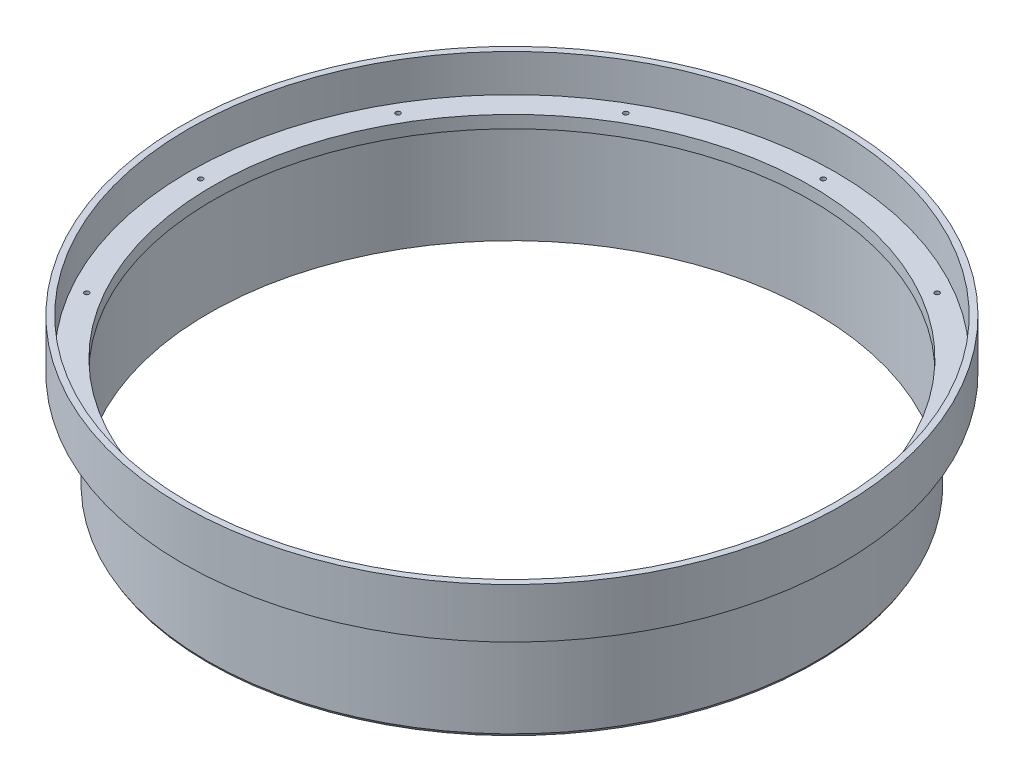
ISO-10303-21;
HEADER;
FILE_DESCRIPTION(('STEP AP214'),'2;1');
FILE_NAME('part.step','',(''),(''),'','','');
FILE_SCHEMA(('AUTOMOTIVE_DESIGN { 1 0 10303 214 1 1 1 1 }'));
ENDSEC;
DATA;
#1=APPLICATION_CONTEXT('core data for automotive mechanical design processes');
#2=APPLICATION_PROTOCOL_DEFINITION('international standard','automotive_design',2000,#1);
#3=PRODUCT_CONTEXT('',#1,'mechanical');
#4=PRODUCT('Part','Part','',(#3));
#5=PRODUCT_RELATED_PRODUCT_CATEGORY('part','',(#4));
#6=PRODUCT_DEFINITION_FORMATION('','',#4);
#7=PRODUCT_DEFINITION_CONTEXT('part definition',#1,'design');
#8=PRODUCT_DEFINITION('design','',#6,#7);
#9=PRODUCT_DEFINITION_SHAPE('','',#8);
#10=(LENGTH_UNIT() NAMED_UNIT(*) SI_UNIT(.MILLI.,.METRE.));
#11=(NAMED_UNIT(*) PLANE_ANGLE_UNIT() SI_UNIT($,.RADIAN.));
#12=(NAMED_UNIT(*) SI_UNIT($,.STERADIAN.) SOLID_ANGLE_UNIT());
#13=UNCERTAINTY_MEASURE_WITH_UNIT(LENGTH_MEASURE(1.E-05),#10,'distance_accuracy_value','');
#14=(GEOMETRIC_REPRESENTATION_CONTEXT(3) GLOBAL_UNCERTAINTY_ASSIGNED_CONTEXT((#13)) GLOBAL_UNIT_ASSIGNED_CONTEXT((#10,
#11,#12)) REPRESENTATION_CONTEXT('',''));
#15=CARTESIAN_POINT('',(0.,0.,0.));
#16=DIRECTION('',(0.,0.,1.));
#17=DIRECTION('',(1.,0.,0.));
#18=AXIS2_PLACEMENT_3D('',#15,#16,#17);
#19=CARTESIAN_POINT('',(-82.3595,0.,0.));
#20=DIRECTION('',(0.,1.,0.));
#21=DIRECTION('',(0.,0.,1.));
#22=AXIS2_PLACEMENT_3D('',#19,#20,#21);
#23=PLANE('',#22);
#24=CARTESIAN_POINT('',(-68.6582775056797,0.,39.6398749999993));
#25=DIRECTION('',(0.,1.,0.));
#26=DIRECTION('',(0.,0.,1.));
#27=AXIS2_PLACEMENT_3D('',#24,#25,#26);
#28=CIRCLE('',#27,0.59563);
#29=CARTESIAN_POINT('',(-68.6582775056797,0.,40.2355049999993));
#30=VERTEX_POINT('',#29);
#31=EDGE_CURVE('E90',#30,#30,#28,.T.);
#32=ORIENTED_EDGE('',*,*,#31,.F.);
#33=EDGE_LOOP('',(#32));
#34=FACE_BOUND('',#33,.T.);
#35=CARTESIAN_POINT('',(-39.6398750000007,0.,68.658277505679));
#36=DIRECTION('',(0.,1.,0.));
#37=DIRECTION('',(0.,0.,1.));
#38=AXIS2_PLACEMENT_3D('',#35,#36,#37);
#39=CIRCLE('',#38,0.59563);
#40=CARTESIAN_POINT('',(-39.6398750000007,0.,69.253907505679));
#41=VERTEX_POINT('',#40);
#42=EDGE_CURVE('E89',#41,#41,#39,.T.);
#43=ORIENTED_EDGE('',*,*,#42,.F.);
#44=EDGE_LOOP('',(#43));
#45=FACE_BOUND('',#44,.T.);
#46=CARTESIAN_POINT('',(-6.89582176881005E-13,0.,79.27975));
#47=DIRECTION('',(0.,1.,0.));
#48=DIRECTION('',(0.,0.,1.));
#49=AXIS2_PLACEMENT_3D('',#46,#47,#48);
#50=CIRCLE('',#49,0.595629999999999);
#51=CARTESIAN_POINT('',(-6.89582176881005E-13,0.,79.87538));
#52=VERTEX_POINT('',#51);
#53=EDGE_CURVE('E100',#52,#52,#50,.T.);
#54=ORIENTED_EDGE('',*,*,#53,.F.);
#55=EDGE_LOOP('',(#54));
#56=FACE_BOUND('',#55,.T.);
#57=CARTESIAN_POINT('',(39.6398749999995,0.,68.6582775056796));
#58=DIRECTION('',(0.,1.,0.));
#59=DIRECTION('',(0.,0.,1.));
#60=AXIS2_PLACEMENT_3D('',#57,#58,#59);
#61=CIRCLE('',#60,0.59563);
#62=CARTESIAN_POINT('',(39.6398749999995,0.,69.2539075056796));
#63=VERTEX_POINT('',#62);
#64=EDGE_CURVE('E106',#63,#63,#61,.T.);
#65=ORIENTED_EDGE('',*,*,#64,.F.);
#66=EDGE_LOOP('',(#65));
#67=FACE_BOUND('',#66,.T.);
#68=CARTESIAN_POINT('',(68.6582775056791,0.,39.6398750000004));
#69=DIRECTION('',(0.,1.,0.));
#70=DIRECTION('',(0.,0.,1.));
#71=AXIS2_PLACEMENT_3D('',#68,#69,#70);
#72=CIRCLE('',#71,0.59563);
#73=CARTESIAN_POINT('',(68.6582775056791,0.,40.2355050000004));
#74=VERTEX_POINT('',#73);
#75=EDGE_CURVE('E112',#74,#74,#72,.T.);
#76=ORIENTED_EDGE('',*,*,#75,.F.);
#77=EDGE_LOOP('',(#76));
#78=FACE_BOUND('',#77,.T.);
#79=CARTESIAN_POINT('',(79.27975,0.,4.47985690742466E-13));
#80=DIRECTION('',(0.,1.,0.));
#81=DIRECTION('',(0.,0.,1.));
#82=AXIS2_PLACEMENT_3D('',#79,#80,#81);
#83=CIRCLE('',#82,0.59563);
#84=CARTESIAN_POINT('',(79.27975,0.,0.595630000000448));
#85=VERTEX_POINT('',#84);
#86=EDGE_CURVE('E118',#85,#85,#83,.T.);
#87=ORIENTED_EDGE('',*,*,#86,.F.);
#88=EDGE_LOOP('',(#87));
#89=FACE_BOUND('',#88,.T.);
#90=CARTESIAN_POINT('',(68.6582775056795,0.,-39.6398749999996));
#91=DIRECTION('',(0.,1.,0.));
#92=DIRECTION('',(0.,0.,1.));
#93=AXIS2_PLACEMENT_3D('',#90,#91,#92);
#94=CIRCLE('',#93,0.59563);
#95=CARTESIAN_POINT('',(68.6582775056795,0.,-39.0442449999996));
#96=VERTEX_POINT('',#95);
#97=EDGE_CURVE('E124',#96,#96,#94,.T.);
#98=ORIENTED_EDGE('',*,*,#97,.F.);
#99=EDGE_LOOP('',(#98));
#100=FACE_BOUND('',#99,.T.);
#101=CARTESIAN_POINT('',(39.6398750000002,0.,-68.6582775056792));
#102=DIRECTION('',(0.,1.,0.));
#103=DIRECTION('',(0.,0.,1.));
#104=AXIS2_PLACEMENT_3D('',#101,#102,#103);
#105=CIRCLE('',#104,0.59563);
#106=CARTESIAN_POINT('',(39.6398750000002,0.,-68.0626475056792));
#107=VERTEX_POINT('',#106);
#108=EDGE_CURVE('E130',#107,#107,#105,.T.);
#109=ORIENTED_EDGE('',*,*,#108,.F.);
#110=EDGE_LOOP('',(#109));
#111=FACE_BOUND('',#110,.T.);
#112=CARTESIAN_POINT('',(2.23992845371233E-13,0.,-79.27975));
#113=DIRECTION('',(0.,1.,0.));
#114=DIRECTION('',(0.,0.,1.));
#115=AXIS2_PLACEMENT_3D('',#112,#113,#114);
#116=CIRCLE('',#115,0.595629999999999);
#117=CARTESIAN_POINT('',(2.23992845371233E-13,0.,-78.68412));
#118=VERTEX_POINT('',#117);
#119=EDGE_CURVE('E136',#118,#118,#116,.T.);
#120=ORIENTED_EDGE('',*,*,#119,.F.);
#121=EDGE_LOOP('',(#120));
#122=FACE_BOUND('',#121,.T.);
#123=CARTESIAN_POINT('',(-39.6398749999999,0.,-68.6582775056794));
#124=DIRECTION('',(0.,1.,0.));
#125=DIRECTION('',(0.,0.,1.));
#126=AXIS2_PLACEMENT_3D('',#123,#124,#125);
#127=CIRCLE('',#126,0.59563);
#128=CARTESIAN_POINT('',(-39.6398749999999,0.,-68.0626475056794));
#129=VERTEX_POINT('',#128);
#130=EDGE_CURVE('E142',#129,#129,#127,.T.);
#131=ORIENTED_EDGE('',*,*,#130,.F.);
#132=EDGE_LOOP('',(#131));
#133=FACE_BOUND('',#132,.T.);
#134=CARTESIAN_POINT('',(-68.6582775056793,0.,-39.6398750000001));
#135=DIRECTION('',(0.,1.,0.));
#136=DIRECTION('',(0.,0.,1.));
#137=AXIS2_PLACEMENT_3D('',#134,#135,#136);
#138=CIRCLE('',#137,0.59563);
#139=CARTESIAN_POINT('',(-68.6582775056793,0.,-39.0442450000001));
#140=VERTEX_POINT('',#139);
#141=EDGE_CURVE('E148',#140,#140,#138,.T.);
#142=ORIENTED_EDGE('',*,*,#141,.F.);
#143=EDGE_LOOP('',(#142));
#144=FACE_BOUND('',#143,.T.);
#145=CARTESIAN_POINT('',(-79.27975,0.,0.));
#146=DIRECTION('',(0.,1.,0.));
#147=DIRECTION('',(0.,0.,1.));
#148=AXIS2_PLACEMENT_3D('',#145,#146,#147);
#149=CIRCLE('',#148,0.59563);
#150=CARTESIAN_POINT('',(-79.27975,0.,0.59563));
#151=VERTEX_POINT('',#150);
#152=EDGE_CURVE('E154',#151,#151,#149,.T.);
#153=ORIENTED_EDGE('',*,*,#152,.F.);
#154=EDGE_LOOP('',(#153));
#155=FACE_BOUND('',#154,.T.);
#156=CARTESIAN_POINT('',(0.,0.,0.));
#157=DIRECTION('',(0.,1.,0.));
#158=DIRECTION('',(0.,0.,1.));
#159=AXIS2_PLACEMENT_3D('',#156,#157,#158);
#160=CIRCLE('',#159,82.3595);
#161=CARTESIAN_POINT('',(0.,0.,82.3595));
#162=VERTEX_POINT('',#161);
#163=EDGE_CURVE('E160',#162,#162,#160,.T.);
#164=ORIENTED_EDGE('',*,*,#163,.T.);
#165=EDGE_LOOP('',(#164));
#166=FACE_BOUND('',#165,.T.);
#167=CARTESIAN_POINT('',(0.,0.,0.));
#168=DIRECTION('',(0.,1.,0.));
#169=DIRECTION('',(0.,0.,1.));
#170=AXIS2_PLACEMENT_3D('',#167,#168,#169);
#171=CIRCLE('',#170,76.2);
#172=CARTESIAN_POINT('',(0.,0.,76.2));
#173=VERTEX_POINT('',#172);
#174=EDGE_CURVE('E11',#173,#173,#171,.T.);
#175=ORIENTED_EDGE('',*,*,#174,.F.);
#176=EDGE_LOOP('',(#175));
#177=FACE_BOUND('',#176,.T.);
#178=ADVANCED_FACE('F35',(#34,#45,#56,#67,#78,#89,#100,#111,#122,#133,#144,#155,#166,#177),#23,.T.);
#179=CARTESIAN_POINT('',(0.,55.,0.));
#180=DIRECTION('',(0.,1.,0.));
#181=DIRECTION('',(0.,0.,1.));
#182=AXIS2_PLACEMENT_3D('',#179,#180,#181);
#183=CYLINDRICAL_SURFACE('',#182,76.2);
#184=ORIENTED_EDGE('',*,*,#174,.T.);
#185=EDGE_LOOP('',(#184));
#186=FACE_BOUND('',#185,.T.);
#187=CARTESIAN_POINT('',(0.,-3.175,0.));
#188=DIRECTION('',(0.,1.,0.));
#189=DIRECTION('',(0.,0.,1.));
#190=AXIS2_PLACEMENT_3D('',#187,#188,#189);
#191=CIRCLE('',#190,76.2);
#192=CARTESIAN_POINT('',(0.,-3.175,76.2));
#193=VERTEX_POINT('',#192);
#194=EDGE_CURVE('E42',#193,#193,#191,.T.);
#195=ORIENTED_EDGE('',*,*,#194,.F.);
#196=EDGE_LOOP('',(#195));
#197=FACE_BOUND('',#196,.T.);
#198=ADVANCED_FACE('F189',(#186,#197),#183,.F.);
#199=CARTESIAN_POINT('',(-76.2,-3.175,0.));
#200=DIRECTION('',(0.,-1.,0.));
#201=DIRECTION('',(0.,0.,-1.));
#202=AXIS2_PLACEMENT_3D('',#199,#200,#201);
#203=PLANE('',#202);
#204=ORIENTED_EDGE('',*,*,#194,.T.);
#205=EDGE_LOOP('',(#204));
#206=FACE_BOUND('',#205,.T.);
#207=CARTESIAN_POINT('',(0.,-3.175,0.));
#208=DIRECTION('',(0.,1.,0.));
#209=DIRECTION('',(0.,0.,1.));
#210=AXIS2_PLACEMENT_3D('',#207,#208,#209);
#211=CIRCLE('',#210,77.216);
#212=CARTESIAN_POINT('',(0.,-3.175,77.216));
#213=VERTEX_POINT('',#212);
#214=EDGE_CURVE('E181',#213,#213,#211,.T.);
#215=ORIENTED_EDGE('',*,*,#214,.F.);
#216=EDGE_LOOP('',(#215));
#217=FACE_BOUND('',#216,.T.);
#218=ADVANCED_FACE('F186',(#206,#217),#203,.T.);
#219=CARTESIAN_POINT('',(0.,55.,0.));
#220=DIRECTION('',(0.,1.,0.));
#221=DIRECTION('',(0.,0.,1.));
#222=AXIS2_PLACEMENT_3D('',#219,#220,#221);
#223=CYLINDRICAL_SURFACE('',#222,77.216);
#224=ORIENTED_EDGE('',*,*,#214,.T.);
#225=EDGE_LOOP('',(#224));
#226=FACE_BOUND('',#225,.T.);
#227=CARTESIAN_POINT('',(0.,-28.575,0.));
#228=DIRECTION('',(0.,1.,0.));
#229=DIRECTION('',(0.,0.,1.));
#230=AXIS2_PLACEMENT_3D('',#227,#228,#229);
#231=CIRCLE('',#230,77.216);
#232=CARTESIAN_POINT('',(0.,-28.575,77.216));
#233=VERTEX_POINT('',#232);
#234=EDGE_CURVE('E178',#233,#233,#231,.T.);
#235=ORIENTED_EDGE('',*,*,#234,.F.);
#236=EDGE_LOOP('',(#235));
#237=FACE_BOUND('',#236,.T.);
#238=ADVANCED_FACE('F196',(#226,#237),#223,.F.);
#239=CARTESIAN_POINT('',(0.,-27.9150886423162,0.));
#240=DIRECTION('',(0.,1.,0.));
#241=DIRECTION('',(0.,0.,1.));
#242=AXIS2_PLACEMENT_3D('',#239,#240,#241);
#243=CONICAL_SURFACE('',#242,77.597,0.523598775598297);
#244=ORIENTED_EDGE('',*,*,#234,.T.);
#245=EDGE_LOOP('',(#244));
#246=FACE_BOUND('',#245,.T.);
#247=CARTESIAN_POINT('',(0.,-27.9150886423162,0.));
#248=DIRECTION('',(0.,1.,0.));
#249=DIRECTION('',(0.,0.,1.));
#250=AXIS2_PLACEMENT_3D('',#247,#248,#249);
#251=CIRCLE('',#250,77.597);
#252=CARTESIAN_POINT('',(0.,-27.9150886423162,77.597));
#253=VERTEX_POINT('',#252);
#254=EDGE_CURVE('E175',#253,#253,#251,.T.);
#255=ORIENTED_EDGE('',*,*,#254,.F.);
#256=EDGE_LOOP('',(#255));
#257=FACE_BOUND('',#256,.T.);
#258=ADVANCED_FACE('F202',(#246,#257),#243,.T.);
#259=CARTESIAN_POINT('',(0.,55.,0.));
#260=DIRECTION('',(0.,1.,0.));
#261=DIRECTION('',(0.,0.,1.));
#262=AXIS2_PLACEMENT_3D('',#259,#260,#261);
#263=CYLINDRICAL_SURFACE('',#262,77.597);
#264=ORIENTED_EDGE('',*,*,#254,.T.);
#265=EDGE_LOOP('',(#264));
#266=FACE_BOUND('',#265,.T.);
#267=CARTESIAN_POINT('',(0.,-3.175,0.));
#268=DIRECTION('',(0.,1.,0.));
#269=DIRECTION('',(0.,0.,1.));
#270=AXIS2_PLACEMENT_3D('',#267,#268,#269);
#271=CIRCLE('',#270,77.597);
#272=CARTESIAN_POINT('',(0.,-3.175,77.597));
#273=VERTEX_POINT('',#272);
#274=EDGE_CURVE('E172',#273,#273,#271,.T.);
#275=ORIENTED_EDGE('',*,*,#274,.F.);
#276=EDGE_LOOP('',(#275));
#277=FACE_BOUND('',#276,.T.);
#278=ADVANCED_FACE('F206',(#266,#277),#263,.T.);
#279=CARTESIAN_POINT('',(-77.597,-3.175,0.));
#280=DIRECTION('',(0.,-1.,0.));
#281=DIRECTION('',(0.,0.,-1.));
#282=AXIS2_PLACEMENT_3D('',#279,#280,#281);
#283=PLANE('',#282);
#284=ORIENTED_EDGE('',*,*,#274,.T.);
#285=EDGE_LOOP('',(#284));
#286=FACE_BOUND('',#285,.T.);
#287=CARTESIAN_POINT('',(0.,-3.175,0.));
#288=DIRECTION('',(0.,1.,0.));
#289=DIRECTION('',(0.,0.,1.));
#290=AXIS2_PLACEMENT_3D('',#287,#288,#289);
#291=CIRCLE('',#290,83.947);
#292=CARTESIAN_POINT('',(0.,-3.175,83.947));
#293=VERTEX_POINT('',#292);
#294=EDGE_CURVE('E169',#293,#293,#291,.T.);
#295=ORIENTED_EDGE('',*,*,#294,.F.);
#296=EDGE_LOOP('',(#295));
#297=FACE_BOUND('',#296,.T.);
#298=ADVANCED_FACE('F210',(#286,#297),#283,.T.);
#299=CARTESIAN_POINT('',(0.,55.,0.));
#300=DIRECTION('',(0.,1.,0.));
#301=DIRECTION('',(0.,0.,1.));
#302=AXIS2_PLACEMENT_3D('',#299,#300,#301);
#303=CYLINDRICAL_SURFACE('',#302,83.947);
#304=ORIENTED_EDGE('',*,*,#294,.T.);
#305=EDGE_LOOP('',(#304));
#306=FACE_BOUND('',#305,.T.);
#307=CARTESIAN_POINT('',(0.,9.525,0.));
#308=DIRECTION('',(0.,1.,0.));
#309=DIRECTION('',(0.,0.,1.));
#310=AXIS2_PLACEMENT_3D('',#307,#308,#309);
#311=CIRCLE('',#310,83.947);
#312=CARTESIAN_POINT('',(0.,9.525,83.947));
#313=VERTEX_POINT('',#312);
#314=EDGE_CURVE('E166',#313,#313,#311,.T.);
#315=ORIENTED_EDGE('',*,*,#314,.F.);
#316=EDGE_LOOP('',(#315));
#317=FACE_BOUND('',#316,.T.);
#318=ADVANCED_FACE('F214',(#306,#317),#303,.T.);
#319=CARTESIAN_POINT('',(-83.947,9.525,0.));
#320=DIRECTION('',(0.,1.,0.));
#321=DIRECTION('',(0.,0.,1.));
#322=AXIS2_PLACEMENT_3D('',#319,#320,#321);
#323=PLANE('',#322);
#324=ORIENTED_EDGE('',*,*,#314,.T.);
#325=EDGE_LOOP('',(#324));
#326=FACE_BOUND('',#325,.T.);
#327=CARTESIAN_POINT('',(0.,9.525,0.));
#328=DIRECTION('',(0.,1.,0.));
#329=DIRECTION('',(0.,0.,1.));
#330=AXIS2_PLACEMENT_3D('',#327,#328,#329);
#331=CIRCLE('',#330,82.3595);
#332=CARTESIAN_POINT('',(0.,9.525,82.3595));
#333=VERTEX_POINT('',#332);
#334=EDGE_CURVE('E163',#333,#333,#331,.T.);
#335=ORIENTED_EDGE('',*,*,#334,.F.);
#336=EDGE_LOOP('',(#335));
#337=FACE_BOUND('',#336,.T.);
#338=ADVANCED_FACE('F218',(#326,#337),#323,.T.);
#339=CARTESIAN_POINT('',(0.,55.,0.));
#340=DIRECTION('',(0.,1.,0.));
#341=DIRECTION('',(0.,0.,1.));
#342=AXIS2_PLACEMENT_3D('',#339,#340,#341);
#343=CYLINDRICAL_SURFACE('',#342,82.3595);
#344=ORIENTED_EDGE('',*,*,#334,.T.);
#345=EDGE_LOOP('',(#344));
#346=FACE_BOUND('',#345,.T.);
#347=ORIENTED_EDGE('',*,*,#163,.F.);
#348=EDGE_LOOP('',(#347));
#349=FACE_BOUND('',#348,.T.);
#350=ADVANCED_FACE('F222',(#346,#349),#343,.F.);
#351=CARTESIAN_POINT('',(-79.27975,-2.54,0.));
#352=DIRECTION('',(0.,1.,0.));
#353=DIRECTION('',(0.,0.,1.));
#354=AXIS2_PLACEMENT_3D('',#351,#352,#353);
#355=CONICAL_SURFACE('',#354,0.59563,1.02974425867665);
#356=CARTESIAN_POINT('',(-79.27975,-2.89789061051139,0.));
#357=VERTEX_POINT('',#356);
#358=VERTEX_LOOP('',#357);
#359=FACE_BOUND('',#358,.T.);
#360=CARTESIAN_POINT('',(-79.27975,-2.54,0.));
#361=DIRECTION('',(0.,1.,0.));
#362=DIRECTION('',(0.,0.,1.));
#363=AXIS2_PLACEMENT_3D('',#360,#361,#362);
#364=CIRCLE('',#363,0.59563);
#365=CARTESIAN_POINT('',(-79.27975,-2.54,0.59563));
#366=VERTEX_POINT('',#365);
#367=EDGE_CURVE('E157',#366,#366,#364,.T.);
#368=ORIENTED_EDGE('',*,*,#367,.T.);
#369=EDGE_LOOP('',(#368));
#370=FACE_BOUND('',#369,.T.);
#371=ADVANCED_FACE('F226',(#359,#370),#355,.F.);
#372=CARTESIAN_POINT('',(-79.27975,0.,0.));
#373=DIRECTION('',(0.,1.,0.));
#374=DIRECTION('',(0.,0.,1.));
#375=AXIS2_PLACEMENT_3D('',#372,#373,#374);
#376=CYLINDRICAL_SURFACE('',#375,0.59563);
#377=ORIENTED_EDGE('',*,*,#367,.F.);
#378=EDGE_LOOP('',(#377));
#379=FACE_BOUND('',#378,.T.);
#380=ORIENTED_EDGE('',*,*,#152,.T.);
#381=EDGE_LOOP('',(#380));
#382=FACE_BOUND('',#381,.T.);
#383=ADVANCED_FACE('F230',(#379,#382),#376,.F.);
#384=CARTESIAN_POINT('',(-68.6582775056793,-2.54,-39.6398750000001));
#385=DIRECTION('',(0.,1.,0.));
#386=DIRECTION('',(0.,0.,1.));
#387=AXIS2_PLACEMENT_3D('',#384,#385,#386);
#388=CONICAL_SURFACE('',#387,0.59563,1.02974425867665);
#389=CARTESIAN_POINT('',(-68.6582775056793,-2.89789061051139,-39.6398750000001));
#390=VERTEX_POINT('',#389);
#391=VERTEX_LOOP('',#390);
#392=FACE_BOUND('',#391,.T.);
#393=CARTESIAN_POINT('',(-68.6582775056793,-2.54,-39.6398750000001));
#394=DIRECTION('',(0.,1.,0.));
#395=DIRECTION('',(0.,0.,1.));
#396=AXIS2_PLACEMENT_3D('',#393,#394,#395);
#397=CIRCLE('',#396,0.59563);
#398=CARTESIAN_POINT('',(-68.6582775056793,-2.54,-39.0442450000001));
#399=VERTEX_POINT('',#398);
#400=EDGE_CURVE('E151',#399,#399,#397,.T.);
#401=ORIENTED_EDGE('',*,*,#400,.T.);
#402=EDGE_LOOP('',(#401));
#403=FACE_BOUND('',#402,.T.);
#404=ADVANCED_FACE('F233',(#392,#403),#388,.F.);
#405=CARTESIAN_POINT('',(-68.6582775056793,0.,-39.6398750000001));
#406=DIRECTION('',(0.,1.,0.));
#407=DIRECTION('',(0.,0.,1.));
#408=AXIS2_PLACEMENT_3D('',#405,#406,#407);
#409=CYLINDRICAL_SURFACE('',#408,0.59563);
#410=ORIENTED_EDGE('',*,*,#400,.F.);
#411=EDGE_LOOP('',(#410));
#412=FACE_BOUND('',#411,.T.);
#413=ORIENTED_EDGE('',*,*,#141,.T.);
#414=EDGE_LOOP('',(#413));
#415=FACE_BOUND('',#414,.T.);
#416=ADVANCED_FACE('F237',(#412,#415),#409,.F.);
#417=CARTESIAN_POINT('',(-39.6398749999999,-2.54,-68.6582775056794));
#418=DIRECTION('',(0.,1.,0.));
#419=DIRECTION('',(0.,0.,1.));
#420=AXIS2_PLACEMENT_3D('',#417,#418,#419);
#421=CONICAL_SURFACE('',#420,0.59563,1.02974425867665);
#422=CARTESIAN_POINT('',(-39.6398749999999,-2.89789061051139,-68.6582775056794));
#423=VERTEX_POINT('',#422);
#424=VERTEX_LOOP('',#423);
#425=FACE_BOUND('',#424,.T.);
#426=CARTESIAN_POINT('',(-39.6398749999999,-2.54,-68.6582775056794));
#427=DIRECTION('',(0.,1.,0.));
#428=DIRECTION('',(0.,0.,1.));
#429=AXIS2_PLACEMENT_3D('',#426,#427,#428);
#430=CIRCLE('',#429,0.59563);
#431=CARTESIAN_POINT('',(-39.6398749999999,-2.54,-68.0626475056794));
#432=VERTEX_POINT('',#431);
#433=EDGE_CURVE('E145',#432,#432,#430,.T.);
#434=ORIENTED_EDGE('',*,*,#433,.T.);
#435=EDGE_LOOP('',(#434));
#436=FACE_BOUND('',#435,.T.);
#437=ADVANCED_FACE('F240',(#425,#436),#421,.F.);
#438=CARTESIAN_POINT('',(-39.6398749999999,0.,-68.6582775056794));
#439=DIRECTION('',(0.,1.,0.));
#440=DIRECTION('',(0.,0.,1.));
#441=AXIS2_PLACEMENT_3D('',#438,#439,#440);
#442=CYLINDRICAL_SURFACE('',#441,0.59563);
#443=ORIENTED_EDGE('',*,*,#433,.F.);
#444=EDGE_LOOP('',(#443));
#445=FACE_BOUND('',#444,.T.);
#446=ORIENTED_EDGE('',*,*,#130,.T.);
#447=EDGE_LOOP('',(#446));
#448=FACE_BOUND('',#447,.T.);
#449=ADVANCED_FACE('F244',(#445,#448),#442,.F.);
#450=CARTESIAN_POINT('',(2.23992845371233E-13,-2.54,-79.27975));
#451=DIRECTION('',(0.,1.,0.));
#452=DIRECTION('',(0.,0.,1.));
#453=AXIS2_PLACEMENT_3D('',#450,#451,#452);
#454=CONICAL_SURFACE('',#453,0.595629999999999,1.02974425867665);
#455=CARTESIAN_POINT('',(2.23283066879145E-13,-2.89789061051139,-79.27975));
#456=VERTEX_POINT('',#455);
#457=VERTEX_LOOP('',#456);
#458=FACE_BOUND('',#457,.T.);
#459=CARTESIAN_POINT('',(2.23992845371233E-13,-2.54,-79.27975));
#460=DIRECTION('',(0.,1.,0.));
#461=DIRECTION('',(0.,0.,1.));
#462=AXIS2_PLACEMENT_3D('',#459,#460,#461);
#463=CIRCLE('',#462,0.595629999999999);
#464=CARTESIAN_POINT('',(2.23992845371233E-13,-2.54,-78.68412));
#465=VERTEX_POINT('',#464);
#466=EDGE_CURVE('E139',#465,#465,#463,.T.);
#467=ORIENTED_EDGE('',*,*,#466,.T.);
#468=EDGE_LOOP('',(#467));
#469=FACE_BOUND('',#468,.T.);
#470=ADVANCED_FACE('F248',(#458,#469),#454,.F.);
#471=CARTESIAN_POINT('',(2.23992845371233E-13,0.,-79.27975));
#472=DIRECTION('',(0.,1.,0.));
#473=DIRECTION('',(0.,0.,1.));
#474=AXIS2_PLACEMENT_3D('',#471,#472,#473);
#475=CYLINDRICAL_SURFACE('',#474,0.595629999999999);
#476=ORIENTED_EDGE('',*,*,#466,.F.);
#477=EDGE_LOOP('',(#476));
#478=FACE_BOUND('',#477,.T.);
#479=ORIENTED_EDGE('',*,*,#119,.T.);
#480=EDGE_LOOP('',(#479));
#481=FACE_BOUND('',#480,.T.);
#482=ADVANCED_FACE('F252',(#478,#481),#475,.F.);
#483=CARTESIAN_POINT('',(39.6398750000002,-2.54,-68.6582775056792));
#484=DIRECTION('',(0.,1.,0.));
#485=DIRECTION('',(0.,0.,1.));
#486=AXIS2_PLACEMENT_3D('',#483,#484,#485);
#487=CONICAL_SURFACE('',#486,0.59563,1.02974425867665);
#488=CARTESIAN_POINT('',(39.6398750000002,-2.89789061051139,-68.6582775056792));
#489=VERTEX_POINT('',#488);
#490=VERTEX_LOOP('',#489);
#491=FACE_BOUND('',#490,.T.);
#492=CARTESIAN_POINT('',(39.6398750000002,-2.54,-68.6582775056792));
#493=DIRECTION('',(0.,1.,0.));
#494=DIRECTION('',(0.,0.,1.));
#495=AXIS2_PLACEMENT_3D('',#492,#493,#494);
#496=CIRCLE('',#495,0.59563);
#497=CARTESIAN_POINT('',(39.6398750000002,-2.54,-68.0626475056792));
#498=VERTEX_POINT('',#497);
#499=EDGE_CURVE('E133',#498,#498,#496,.T.);
#500=ORIENTED_EDGE('',*,*,#499,.T.);
#501=EDGE_LOOP('',(#500));
#502=FACE_BOUND('',#501,.T.);
#503=ADVANCED_FACE('F256',(#491,#502),#487,.F.);
#504=CARTESIAN_POINT('',(39.6398750000002,0.,-68.6582775056792));
#505=DIRECTION('',(0.,1.,0.));
#506=DIRECTION('',(0.,0.,1.));
#507=AXIS2_PLACEMENT_3D('',#504,#505,#506);
#508=CYLINDRICAL_SURFACE('',#507,0.59563);
#509=ORIENTED_EDGE('',*,*,#499,.F.);
#510=EDGE_LOOP('',(#509));
#511=FACE_BOUND('',#510,.T.);
#512=ORIENTED_EDGE('',*,*,#108,.T.);
#513=EDGE_LOOP('',(#512));
#514=FACE_BOUND('',#513,.T.);
#515=ADVANCED_FACE('F260',(#511,#514),#508,.F.);
#516=CARTESIAN_POINT('',(68.6582775056795,-2.54,-39.6398749999996));
#517=DIRECTION('',(0.,1.,0.));
#518=DIRECTION('',(0.,0.,1.));
#519=AXIS2_PLACEMENT_3D('',#516,#517,#518);
#520=CONICAL_SURFACE('',#519,0.59563,1.02974425867665);
#521=CARTESIAN_POINT('',(68.6582775056795,-2.89789061051139,-39.6398749999996));
#522=VERTEX_POINT('',#521);
#523=VERTEX_LOOP('',#522);
#524=FACE_BOUND('',#523,.T.);
#525=CARTESIAN_POINT('',(68.6582775056795,-2.54,-39.6398749999996));
#526=DIRECTION('',(0.,1.,0.));
#527=DIRECTION('',(0.,0.,1.));
#528=AXIS2_PLACEMENT_3D('',#525,#526,#527);
#529=CIRCLE('',#528,0.59563);
#530=CARTESIAN_POINT('',(68.6582775056795,-2.54,-39.0442449999996));
#531=VERTEX_POINT('',#530);
#532=EDGE_CURVE('E127',#531,#531,#529,.T.);
#533=ORIENTED_EDGE('',*,*,#532,.T.);
#534=EDGE_LOOP('',(#533));
#535=FACE_BOUND('',#534,.T.);
#536=ADVANCED_FACE('F264',(#524,#535),#520,.F.);
#537=CARTESIAN_POINT('',(68.6582775056795,0.,-39.6398749999996));
#538=DIRECTION('',(0.,1.,0.));
#539=DIRECTION('',(0.,0.,1.));
#540=AXIS2_PLACEMENT_3D('',#537,#538,#539);
#541=CYLINDRICAL_SURFACE('',#540,0.59563);
#542=ORIENTED_EDGE('',*,*,#532,.F.);
#543=EDGE_LOOP('',(#542));
#544=FACE_BOUND('',#543,.T.);
#545=ORIENTED_EDGE('',*,*,#97,.T.);
#546=EDGE_LOOP('',(#545));
#547=FACE_BOUND('',#546,.T.);
#548=ADVANCED_FACE('F268',(#544,#547),#541,.F.);
#549=CARTESIAN_POINT('',(79.27975,-2.54,4.47985690742466E-13));
#550=DIRECTION('',(0.,1.,0.));
#551=DIRECTION('',(0.,0.,1.));
#552=AXIS2_PLACEMENT_3D('',#549,#550,#551);
#553=CONICAL_SURFACE('',#552,0.59563,1.02974425867665);
#554=CARTESIAN_POINT('',(79.27975,-2.89789061051139,4.47985690742466E-13));
#555=VERTEX_POINT('',#554);
#556=VERTEX_LOOP('',#555);
#557=FACE_BOUND('',#556,.T.);
#558=CARTESIAN_POINT('',(79.27975,-2.54,4.47985690742466E-13));
#559=DIRECTION('',(0.,1.,0.));
#560=DIRECTION('',(0.,0.,1.));
#561=AXIS2_PLACEMENT_3D('',#558,#559,#560);
#562=CIRCLE('',#561,0.59563);
#563=CARTESIAN_POINT('',(79.27975,-2.54,0.595630000000448));
#564=VERTEX_POINT('',#563);
#565=EDGE_CURVE('E121',#564,#564,#562,.T.);
#566=ORIENTED_EDGE('',*,*,#565,.T.);
#567=EDGE_LOOP('',(#566));
#568=FACE_BOUND('',#567,.T.);
#569=ADVANCED_FACE('F272',(#557,#568),#553,.F.);
#570=CARTESIAN_POINT('',(79.27975,0.,4.47985690742466E-13));
#571=DIRECTION('',(0.,1.,0.));
#572=DIRECTION('',(0.,0.,1.));
#573=AXIS2_PLACEMENT_3D('',#570,#571,#572);
#574=CYLINDRICAL_SURFACE('',#573,0.59563);
#575=ORIENTED_EDGE('',*,*,#565,.F.);
#576=EDGE_LOOP('',(#575));
#577=FACE_BOUND('',#576,.T.);
#578=ORIENTED_EDGE('',*,*,#86,.T.);
#579=EDGE_LOOP('',(#578));
#580=FACE_BOUND('',#579,.T.);
#581=ADVANCED_FACE('F276',(#577,#580),#574,.F.);
#582=CARTESIAN_POINT('',(68.6582775056791,-2.54,39.6398750000004));
#583=DIRECTION('',(0.,1.,0.));
#584=DIRECTION('',(0.,0.,1.));
#585=AXIS2_PLACEMENT_3D('',#582,#583,#584);
#586=CONICAL_SURFACE('',#585,0.59563,1.02974425867665);
#587=CARTESIAN_POINT('',(68.6582775056791,-2.89789061051139,39.6398750000004));
#588=VERTEX_POINT('',#587);
#589=VERTEX_LOOP('',#588);
#590=FACE_BOUND('',#589,.T.);
#591=CARTESIAN_POINT('',(68.6582775056791,-2.54,39.6398750000004));
#592=DIRECTION('',(0.,1.,0.));
#593=DIRECTION('',(0.,0.,1.));
#594=AXIS2_PLACEMENT_3D('',#591,#592,#593);
#595=CIRCLE('',#594,0.59563);
#596=CARTESIAN_POINT('',(68.6582775056791,-2.54,40.2355050000004));
#597=VERTEX_POINT('',#596);
#598=EDGE_CURVE('E115',#597,#597,#595,.T.);
#599=ORIENTED_EDGE('',*,*,#598,.T.);
#600=EDGE_LOOP('',(#599));
#601=FACE_BOUND('',#600,.T.);
#602=ADVANCED_FACE('F280',(#590,#601),#586,.F.);
#603=CARTESIAN_POINT('',(68.6582775056791,0.,39.6398750000004));
#604=DIRECTION('',(0.,1.,0.));
#605=DIRECTION('',(0.,0.,1.));
#606=AXIS2_PLACEMENT_3D('',#603,#604,#605);
#607=CYLINDRICAL_SURFACE('',#606,0.59563);
#608=ORIENTED_EDGE('',*,*,#598,.F.);
#609=EDGE_LOOP('',(#608));
#610=FACE_BOUND('',#609,.T.);
#611=ORIENTED_EDGE('',*,*,#75,.T.);
#612=EDGE_LOOP('',(#611));
#613=FACE_BOUND('',#612,.T.);
#614=ADVANCED_FACE('F284',(#610,#613),#607,.F.);
#615=CARTESIAN_POINT('',(39.6398749999995,-2.54,68.6582775056796));
#616=DIRECTION('',(0.,1.,0.));
#617=DIRECTION('',(0.,0.,1.));
#618=AXIS2_PLACEMENT_3D('',#615,#616,#617);
#619=CONICAL_SURFACE('',#618,0.59563,1.02974425867665);
#620=CARTESIAN_POINT('',(39.6398749999995,-2.89789061051139,68.6582775056796));
#621=VERTEX_POINT('',#620);
#622=VERTEX_LOOP('',#621);
#623=FACE_BOUND('',#622,.T.);
#624=CARTESIAN_POINT('',(39.6398749999995,-2.54,68.6582775056796));
#625=DIRECTION('',(0.,1.,0.));
#626=DIRECTION('',(0.,0.,1.));
#627=AXIS2_PLACEMENT_3D('',#624,#625,#626);
#628=CIRCLE('',#627,0.59563);
#629=CARTESIAN_POINT('',(39.6398749999995,-2.54,69.2539075056796));
#630=VERTEX_POINT('',#629);
#631=EDGE_CURVE('E109',#630,#630,#628,.T.);
#632=ORIENTED_EDGE('',*,*,#631,.T.);
#633=EDGE_LOOP('',(#632));
#634=FACE_BOUND('',#633,.T.);
#635=ADVANCED_FACE('F288',(#623,#634),#619,.F.);
#636=CARTESIAN_POINT('',(39.6398749999995,0.,68.6582775056796));
#637=DIRECTION('',(0.,1.,0.));
#638=DIRECTION('',(0.,0.,1.));
#639=AXIS2_PLACEMENT_3D('',#636,#637,#638);
#640=CYLINDRICAL_SURFACE('',#639,0.59563);
#641=ORIENTED_EDGE('',*,*,#631,.F.);
#642=EDGE_LOOP('',(#641));
#643=FACE_BOUND('',#642,.T.);
#644=ORIENTED_EDGE('',*,*,#64,.T.);
#645=EDGE_LOOP('',(#644));
#646=FACE_BOUND('',#645,.T.);
#647=ADVANCED_FACE('F292',(#643,#646),#640,.F.);
#648=CARTESIAN_POINT('',(-6.89582176881005E-13,-2.54,79.27975));
#649=DIRECTION('',(0.,1.,0.));
#650=DIRECTION('',(0.,0.,1.));
#651=AXIS2_PLACEMENT_3D('',#648,#649,#650);
#652=CONICAL_SURFACE('',#651,0.595629999999999,1.02974425867665);
#653=CARTESIAN_POINT('',(-6.90291955373093E-13,-2.89789061051139,79.27975));
#654=VERTEX_POINT('',#653);
#655=VERTEX_LOOP('',#654);
#656=FACE_BOUND('',#655,.T.);
#657=CARTESIAN_POINT('',(-6.89582176881005E-13,-2.54,79.27975));
#658=DIRECTION('',(0.,1.,0.));
#659=DIRECTION('',(0.,0.,1.));
#660=AXIS2_PLACEMENT_3D('',#657,#658,#659);
#661=CIRCLE('',#660,0.595629999999999);
#662=CARTESIAN_POINT('',(-6.89582176881005E-13,-2.54,79.87538));
#663=VERTEX_POINT('',#662);
#664=EDGE_CURVE('E103',#663,#663,#661,.T.);
#665=ORIENTED_EDGE('',*,*,#664,.T.);
#666=EDGE_LOOP('',(#665));
#667=FACE_BOUND('',#666,.T.);
#668=ADVANCED_FACE('F296',(#656,#667),#652,.F.);
#669=CARTESIAN_POINT('',(-6.89582176881005E-13,0.,79.27975));
#670=DIRECTION('',(0.,1.,0.));
#671=DIRECTION('',(0.,0.,1.));
#672=AXIS2_PLACEMENT_3D('',#669,#670,#671);
#673=CYLINDRICAL_SURFACE('',#672,0.595629999999999);
#674=ORIENTED_EDGE('',*,*,#664,.F.);
#675=EDGE_LOOP('',(#674));
#676=FACE_BOUND('',#675,.T.);
#677=ORIENTED_EDGE('',*,*,#53,.T.);
#678=EDGE_LOOP('',(#677));
#679=FACE_BOUND('',#678,.T.);
#680=ADVANCED_FACE('F300',(#676,#679),#673,.F.);
#681=CARTESIAN_POINT('',(-39.6398750000007,-2.54,68.658277505679));
#682=DIRECTION('',(0.,1.,0.));
#683=DIRECTION('',(0.,0.,1.));
#684=AXIS2_PLACEMENT_3D('',#681,#682,#683);
#685=CONICAL_SURFACE('',#684,0.59563,1.02974425867665);
#686=CARTESIAN_POINT('',(-39.6398750000007,-2.89789061051139,68.658277505679));
#687=VERTEX_POINT('',#686);
#688=VERTEX_LOOP('',#687);
#689=FACE_BOUND('',#688,.T.);
#690=CARTESIAN_POINT('',(-39.6398750000007,-2.54,68.658277505679));
#691=DIRECTION('',(0.,1.,0.));
#692=DIRECTION('',(0.,0.,1.));
#693=AXIS2_PLACEMENT_3D('',#690,#691,#692);
#694=CIRCLE('',#693,0.59563);
#695=CARTESIAN_POINT('',(-39.6398750000007,-2.54,69.253907505679));
#696=VERTEX_POINT('',#695);
#697=EDGE_CURVE('E93',#696,#696,#694,.T.);
#698=ORIENTED_EDGE('',*,*,#697,.T.);
#699=EDGE_LOOP('',(#698));
#700=FACE_BOUND('',#699,.T.);
#701=ADVANCED_FACE('F304',(#689,#700),#685,.F.);
#702=CARTESIAN_POINT('',(-39.6398750000007,0.,68.658277505679));
#703=DIRECTION('',(0.,1.,0.));
#704=DIRECTION('',(0.,0.,1.));
#705=AXIS2_PLACEMENT_3D('',#702,#703,#704);
#706=CYLINDRICAL_SURFACE('',#705,0.59563);
#707=ORIENTED_EDGE('',*,*,#697,.F.);
#708=EDGE_LOOP('',(#707));
#709=FACE_BOUND('',#708,.T.);
#710=ORIENTED_EDGE('',*,*,#42,.T.);
#711=EDGE_LOOP('',(#710));
#712=FACE_BOUND('',#711,.T.);
#713=ADVANCED_FACE('F83',(#709,#712),#706,.F.);
#714=CARTESIAN_POINT('',(-68.6582775056797,-2.54,39.6398749999993));
#715=DIRECTION('',(0.,1.,0.));
#716=DIRECTION('',(0.,0.,1.));
#717=AXIS2_PLACEMENT_3D('',#714,#715,#716);
#718=CONICAL_SURFACE('',#717,0.59563,1.02974425867665);
#719=CARTESIAN_POINT('',(-68.6582775056797,-2.89789061051139,39.6398749999993));
#720=VERTEX_POINT('',#719);
#721=VERTEX_LOOP('',#720);
#722=FACE_BOUND('',#721,.T.);
#723=CARTESIAN_POINT('',(-68.6582775056797,-2.54,39.6398749999993));
#724=DIRECTION('',(0.,1.,0.));
#725=DIRECTION('',(0.,0.,1.));
#726=AXIS2_PLACEMENT_3D('',#723,#724,#725);
#727=CIRCLE('',#726,0.59563);
#728=CARTESIAN_POINT('',(-68.6582775056797,-2.54,40.2355049999993));
#729=VERTEX_POINT('',#728);
#730=EDGE_CURVE('E87',#729,#729,#727,.T.);
#731=ORIENTED_EDGE('',*,*,#730,.T.);
#732=EDGE_LOOP('',(#731));
#733=FACE_BOUND('',#732,.T.);
#734=ADVANCED_FACE('F79',(#722,#733),#718,.F.);
#735=CARTESIAN_POINT('',(-68.6582775056797,0.,39.6398749999993));
#736=DIRECTION('',(0.,1.,0.));
#737=DIRECTION('',(0.,0.,1.));
#738=AXIS2_PLACEMENT_3D('',#735,#736,#737);
#739=CYLINDRICAL_SURFACE('',#738,0.59563);
#740=ORIENTED_EDGE('',*,*,#730,.F.);
#741=EDGE_LOOP('',(#740));
#742=FACE_BOUND('',#741,.T.);
#743=ORIENTED_EDGE('',*,*,#31,.T.);
#744=EDGE_LOOP('',(#743));
#745=FACE_BOUND('',#744,.T.);
#746=ADVANCED_FACE('F82',(#742,#745),#739,.F.);
#747=CLOSED_SHELL('',(#178,#198,#218,#238,#258,#278,#298,#318,#338,#350,#371,#383,#404,#416,
#437,#449,#470,#482,#503,#515,#536,#548,#569,#581,#602,#614,#635,#647,#668,#680,#701,#713,#734,#746));
#748=MANIFOLD_SOLID_BREP('B2',#747);
#749=ADVANCED_BREP_SHAPE_REPRESENTATION('',(#18,#748),#14);
#750=SHAPE_DEFINITION_REPRESENTATION(#9,#749);
ENDSEC;
END-ISO-10303-21;
